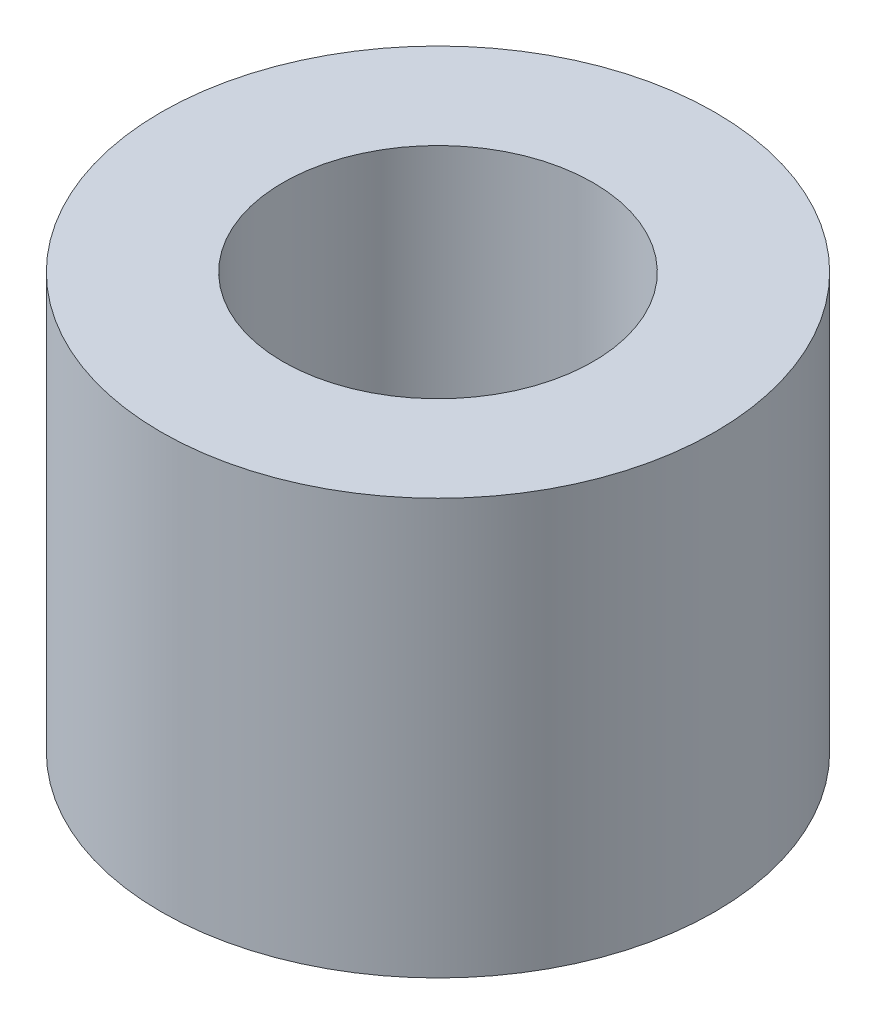
ISO-10303-21;
HEADER;
FILE_DESCRIPTION(('STEP AP214'),'2;1');
FILE_NAME('part.step','',(''),(''),'','','');
FILE_SCHEMA(('AUTOMOTIVE_DESIGN { 1 0 10303 214 1 1 1 1 }'));
ENDSEC;
DATA;
#1=APPLICATION_CONTEXT('core data for automotive mechanical design processes');
#2=APPLICATION_PROTOCOL_DEFINITION('international standard','automotive_design',2000,#1);
#3=PRODUCT_CONTEXT('',#1,'mechanical');
#4=PRODUCT('Part','Part','',(#3));
#5=PRODUCT_RELATED_PRODUCT_CATEGORY('part','',(#4));
#6=PRODUCT_DEFINITION_FORMATION('','',#4);
#7=PRODUCT_DEFINITION_CONTEXT('part definition',#1,'design');
#8=PRODUCT_DEFINITION('design','',#6,#7);
#9=PRODUCT_DEFINITION_SHAPE('','',#8);
#10=(LENGTH_UNIT() NAMED_UNIT(*) SI_UNIT(.MILLI.,.METRE.));
#11=(NAMED_UNIT(*) PLANE_ANGLE_UNIT() SI_UNIT($,.RADIAN.));
#12=(NAMED_UNIT(*) SI_UNIT($,.STERADIAN.) SOLID_ANGLE_UNIT());
#13=UNCERTAINTY_MEASURE_WITH_UNIT(LENGTH_MEASURE(1.E-05),#10,'distance_accuracy_value','');
#14=(GEOMETRIC_REPRESENTATION_CONTEXT(3) GLOBAL_UNCERTAINTY_ASSIGNED_CONTEXT((#13)) GLOBAL_UNIT_ASSIGNED_CONTEXT((#10,
#11,#12)) REPRESENTATION_CONTEXT('',''));
#15=CARTESIAN_POINT('',(0.,0.,0.));
#16=DIRECTION('',(0.,0.,1.));
#17=DIRECTION('',(1.,0.,0.));
#18=AXIS2_PLACEMENT_3D('',#15,#16,#17);
#19=CARTESIAN_POINT('',(0.,4.7625,0.));
#20=DIRECTION('',(0.,-1.,0.));
#21=DIRECTION('',(0.,0.,-1.));
#22=AXIS2_PLACEMENT_3D('',#19,#20,#21);
#23=CYLINDRICAL_SURFACE('',#22,3.175);
#24=CARTESIAN_POINT('',(0.,4.7625,0.));
#25=DIRECTION('',(0.,1.,0.));
#26=DIRECTION('',(0.,0.,1.));
#27=AXIS2_PLACEMENT_3D('',#24,#25,#26);
#28=CIRCLE('',#27,3.175);
#29=CARTESIAN_POINT('',(0.,4.7625,3.175));
#30=VERTEX_POINT('',#29);
#31=EDGE_CURVE('E10',#30,#30,#28,.T.);
#32=ORIENTED_EDGE('',*,*,#31,.F.);
#33=EDGE_LOOP('',(#32));
#34=FACE_BOUND('',#33,.T.);
#35=CARTESIAN_POINT('',(0.,0.,0.));
#36=DIRECTION('',(0.,1.,0.));
#37=DIRECTION('',(0.,0.,1.));
#38=AXIS2_PLACEMENT_3D('',#35,#36,#37);
#39=CIRCLE('',#38,3.175);
#40=CARTESIAN_POINT('',(0.,0.,3.175));
#41=VERTEX_POINT('',#40);
#42=EDGE_CURVE('E37',#41,#41,#39,.T.);
#43=ORIENTED_EDGE('',*,*,#42,.T.);
#44=EDGE_LOOP('',(#43));
#45=FACE_BOUND('',#44,.T.);
#46=ADVANCED_FACE('F30',(#34,#45),#23,.T.);
#47=CARTESIAN_POINT('',(0.,4.7625,0.));
#48=DIRECTION('',(0.,1.,0.));
#49=DIRECTION('',(0.,0.,1.));
#50=AXIS2_PLACEMENT_3D('',#47,#48,#49);
#51=PLANE('',#50);
#52=CARTESIAN_POINT('',(0.,4.7625,0.));
#53=DIRECTION('',(0.,1.,0.));
#54=DIRECTION('',(0.,0.,1.));
#55=AXIS2_PLACEMENT_3D('',#52,#53,#54);
#56=CIRCLE('',#55,1.778);
#57=CARTESIAN_POINT('',(0.,4.7625,1.778));
#58=VERTEX_POINT('',#57);
#59=EDGE_CURVE('E43',#58,#58,#56,.T.);
#60=ORIENTED_EDGE('',*,*,#59,.F.);
#61=EDGE_LOOP('',(#60));
#62=FACE_BOUND('',#61,.T.);
#63=ORIENTED_EDGE('',*,*,#31,.T.);
#64=EDGE_LOOP('',(#63));
#65=FACE_BOUND('',#64,.T.);
#66=ADVANCED_FACE('F59',(#62,#65),#51,.T.);
#67=CARTESIAN_POINT('',(0.,0.,0.));
#68=DIRECTION('',(0.,1.,0.));
#69=DIRECTION('',(0.,0.,1.));
#70=AXIS2_PLACEMENT_3D('',#67,#68,#69);
#71=PLANE('',#70);
#72=CARTESIAN_POINT('',(0.,0.,0.));
#73=DIRECTION('',(0.,1.,0.));
#74=DIRECTION('',(0.,0.,1.));
#75=AXIS2_PLACEMENT_3D('',#72,#73,#74);
#76=CIRCLE('',#75,1.778);
#77=CARTESIAN_POINT('',(0.,0.,1.778));
#78=VERTEX_POINT('',#77);
#79=EDGE_CURVE('E33',#78,#78,#76,.T.);
#80=ORIENTED_EDGE('',*,*,#79,.T.);
#81=EDGE_LOOP('',(#80));
#82=FACE_BOUND('',#81,.T.);
#83=ORIENTED_EDGE('',*,*,#42,.F.);
#84=EDGE_LOOP('',(#83));
#85=FACE_BOUND('',#84,.T.);
#86=ADVANCED_FACE('F50',(#82,#85),#71,.F.);
#87=CARTESIAN_POINT('',(0.,4.7625,0.));
#88=DIRECTION('',(0.,1.,0.));
#89=DIRECTION('',(0.,0.,1.));
#90=AXIS2_PLACEMENT_3D('',#87,#88,#89);
#91=CYLINDRICAL_SURFACE('',#90,1.778);
#92=ORIENTED_EDGE('',*,*,#59,.T.);
#93=EDGE_LOOP('',(#92));
#94=FACE_BOUND('',#93,.T.);
#95=ORIENTED_EDGE('',*,*,#79,.F.);
#96=EDGE_LOOP('',(#95));
#97=FACE_BOUND('',#96,.T.);
#98=ADVANCED_FACE('F53',(#94,#97),#91,.F.);
#99=CLOSED_SHELL('',(#46,#66,#86,#98));
#100=MANIFOLD_SOLID_BREP('B2',#99);
#101=ADVANCED_BREP_SHAPE_REPRESENTATION('',(#18,#100),#14);
#102=SHAPE_DEFINITION_REPRESENTATION(#9,#101);
ENDSEC;
END-ISO-10303-21;
